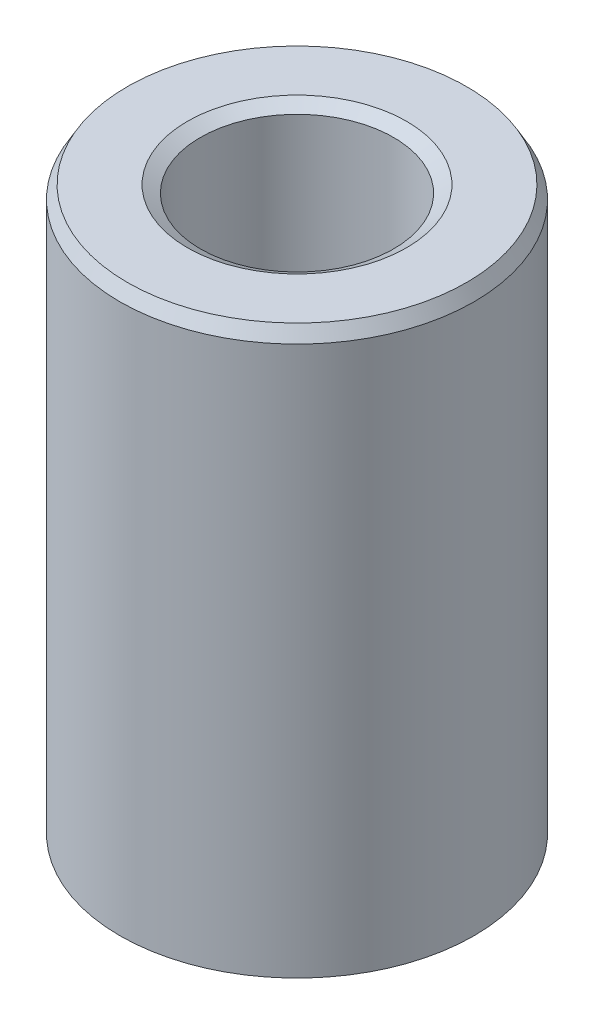
ISO-10303-21;
HEADER;
FILE_DESCRIPTION(('STEP AP214'),'2;1');
FILE_NAME('part.step','',(''),(''),'','','');
FILE_SCHEMA(('AUTOMOTIVE_DESIGN { 1 0 10303 214 1 1 1 1 }'));
ENDSEC;
DATA;
#1=APPLICATION_CONTEXT('core data for automotive mechanical design processes');
#2=APPLICATION_PROTOCOL_DEFINITION('international standard','automotive_design',2000,#1);
#3=PRODUCT_CONTEXT('',#1,'mechanical');
#4=PRODUCT('Part','Part','',(#3));
#5=PRODUCT_RELATED_PRODUCT_CATEGORY('part','',(#4));
#6=PRODUCT_DEFINITION_FORMATION('','',#4);
#7=PRODUCT_DEFINITION_CONTEXT('part definition',#1,'design');
#8=PRODUCT_DEFINITION('design','',#6,#7);
#9=PRODUCT_DEFINITION_SHAPE('','',#8);
#10=(LENGTH_UNIT() NAMED_UNIT(*) SI_UNIT(.MILLI.,.METRE.));
#11=(NAMED_UNIT(*) PLANE_ANGLE_UNIT() SI_UNIT($,.RADIAN.));
#12=(NAMED_UNIT(*) SI_UNIT($,.STERADIAN.) SOLID_ANGLE_UNIT());
#13=UNCERTAINTY_MEASURE_WITH_UNIT(LENGTH_MEASURE(1.E-05),#10,'distance_accuracy_value','');
#14=(GEOMETRIC_REPRESENTATION_CONTEXT(3) GLOBAL_UNCERTAINTY_ASSIGNED_CONTEXT((#13)) GLOBAL_UNIT_ASSIGNED_CONTEXT((#10,
#11,#12)) REPRESENTATION_CONTEXT('',''));
#15=CARTESIAN_POINT('',(0.,0.,0.));
#16=DIRECTION('',(0.,0.,1.));
#17=DIRECTION('',(1.,0.,0.));
#18=AXIS2_PLACEMENT_3D('',#15,#16,#17);
#19=CARTESIAN_POINT('',(0.,16.0737459740507,0.));
#20=DIRECTION('',(0.,-1.,0.));
#21=DIRECTION('',(0.,0.,-1.));
#22=AXIS2_PLACEMENT_3D('',#19,#20,#21);
#23=CYLINDRICAL_SURFACE('',#22,5.);
#24=CARTESIAN_POINT('',(0.,0.211234160088856,0.));
#25=DIRECTION('',(0.,1.,0.));
#26=DIRECTION('',(0.,0.,1.));
#27=AXIS2_PLACEMENT_3D('',#24,#25,#26);
#28=CIRCLE('',#27,5.);
#29=CARTESIAN_POINT('',(0.,0.211234160088856,5.));
#30=VERTEX_POINT('',#29);
#31=EDGE_CURVE('E10',#30,#30,#28,.T.);
#32=ORIENTED_EDGE('',*,*,#31,.T.);
#33=EDGE_LOOP('',(#32));
#34=FACE_BOUND('',#33,.T.);
#35=CARTESIAN_POINT('',(0.,15.7078776764826,0.));
#36=DIRECTION('',(0.,1.,0.));
#37=DIRECTION('',(0.,0.,1.));
#38=AXIS2_PLACEMENT_3D('',#35,#36,#37);
#39=CIRCLE('',#38,5.);
#40=CARTESIAN_POINT('',(0.,15.7078776764826,5.));
#41=VERTEX_POINT('',#40);
#42=EDGE_CURVE('E50',#41,#41,#39,.F.);
#43=ORIENTED_EDGE('',*,*,#42,.T.);
#44=EDGE_LOOP('',(#43));
#45=FACE_BOUND('',#44,.T.);
#46=ADVANCED_FACE('F39',(#34,#45),#23,.T.);
#47=CARTESIAN_POINT('',(0.,16.0737459740507,0.));
#48=DIRECTION('',(0.,1.,0.));
#49=DIRECTION('',(0.,0.,1.));
#50=AXIS2_PLACEMENT_3D('',#47,#48,#49);
#51=PLANE('',#50);
#52=CARTESIAN_POINT('',(0.,16.0737459740507,0.));
#53=DIRECTION('',(0.,1.,0.));
#54=DIRECTION('',(0.,0.,1.));
#55=AXIS2_PLACEMENT_3D('',#52,#53,#54);
#56=CIRCLE('',#55,3.09296491608911);
#57=CARTESIAN_POINT('',(0.,16.0737459740507,3.09296491608911));
#58=VERTEX_POINT('',#57);
#59=EDGE_CURVE('E58',#58,#58,#56,.F.);
#60=ORIENTED_EDGE('',*,*,#59,.T.);
#61=EDGE_LOOP('',(#60));
#62=FACE_BOUND('',#61,.T.);
#63=CARTESIAN_POINT('',(0.,16.0737459740507,0.));
#64=DIRECTION('',(0.,1.,0.));
#65=DIRECTION('',(0.,0.,1.));
#66=AXIS2_PLACEMENT_3D('',#63,#64,#65);
#67=CIRCLE('',#66,4.78876583991115);
#68=CARTESIAN_POINT('',(0.,16.0737459740507,4.78876583991115));
#69=VERTEX_POINT('',#68);
#70=EDGE_CURVE('E61',#69,#69,#67,.T.);
#71=ORIENTED_EDGE('',*,*,#70,.T.);
#72=EDGE_LOOP('',(#71));
#73=FACE_BOUND('',#72,.T.);
#74=ADVANCED_FACE('F88',(#62,#73),#51,.T.);
#75=CARTESIAN_POINT('',(0.,0.,0.));
#76=DIRECTION('',(0.,1.,0.));
#77=DIRECTION('',(0.,0.,1.));
#78=AXIS2_PLACEMENT_3D('',#75,#76,#77);
#79=PLANE('',#78);
#80=CARTESIAN_POINT('',(0.,0.,0.));
#81=DIRECTION('',(0.,1.,0.));
#82=DIRECTION('',(0.,0.,1.));
#83=AXIS2_PLACEMENT_3D('',#80,#81,#82);
#84=CIRCLE('',#83,2.93833077860993);
#85=CARTESIAN_POINT('',(0.,0.,2.93833077860993));
#86=VERTEX_POINT('',#85);
#87=EDGE_CURVE('E51',#86,#86,#84,.T.);
#88=ORIENTED_EDGE('',*,*,#87,.T.);
#89=EDGE_LOOP('',(#88));
#90=FACE_BOUND('',#89,.T.);
#91=CARTESIAN_POINT('',(0.,0.,0.));
#92=DIRECTION('',(0.,1.,0.));
#93=DIRECTION('',(0.,0.,1.));
#94=AXIS2_PLACEMENT_3D('',#91,#92,#93);
#95=CIRCLE('',#94,4.63413170243197);
#96=CARTESIAN_POINT('',(0.,0.,4.63413170243197));
#97=VERTEX_POINT('',#96);
#98=EDGE_CURVE('E54',#97,#97,#95,.F.);
#99=ORIENTED_EDGE('',*,*,#98,.T.);
#100=EDGE_LOOP('',(#99));
#101=FACE_BOUND('',#100,.T.);
#102=ADVANCED_FACE('F83',(#90,#101),#79,.F.);
#103=CARTESIAN_POINT('',(0.,16.0737459740507,0.));
#104=DIRECTION('',(0.,-1.,0.));
#105=DIRECTION('',(0.,0.,-1.));
#106=AXIS2_PLACEMENT_3D('',#103,#104,#105);
#107=CYLINDRICAL_SURFACE('',#106,2.72709661852107);
#108=CARTESIAN_POINT('',(0.,15.8625118139618,0.));
#109=DIRECTION('',(0.,1.,0.));
#110=DIRECTION('',(0.,0.,1.));
#111=AXIS2_PLACEMENT_3D('',#108,#109,#110);
#112=CIRCLE('',#111,2.72709661852107);
#113=CARTESIAN_POINT('',(0.,15.8625118139618,2.72709661852107));
#114=VERTEX_POINT('',#113);
#115=EDGE_CURVE('E67',#114,#114,#112,.T.);
#116=ORIENTED_EDGE('',*,*,#115,.T.);
#117=EDGE_LOOP('',(#116));
#118=FACE_BOUND('',#117,.T.);
#119=CARTESIAN_POINT('',(0.,0.365868297568042,0.));
#120=DIRECTION('',(0.,1.,0.));
#121=DIRECTION('',(0.,0.,1.));
#122=AXIS2_PLACEMENT_3D('',#119,#120,#121);
#123=CIRCLE('',#122,2.72709661852107);
#124=CARTESIAN_POINT('',(0.,0.365868297568042,2.72709661852107));
#125=VERTEX_POINT('',#124);
#126=EDGE_CURVE('E69',#125,#125,#123,.F.);
#127=ORIENTED_EDGE('',*,*,#126,.T.);
#128=EDGE_LOOP('',(#127));
#129=FACE_BOUND('',#128,.T.);
#130=ADVANCED_FACE('F71',(#118,#129),#107,.F.);
#131=CARTESIAN_POINT('',(0.,15.8625118139618,0.));
#132=DIRECTION('',(0.,1.,0.));
#133=DIRECTION('',(0.,0.,1.));
#134=AXIS2_PLACEMENT_3D('',#131,#132,#133);
#135=CONICAL_SURFACE('',#134,2.72709661852107,1.0471975511966);
#136=ORIENTED_EDGE('',*,*,#59,.F.);
#137=EDGE_LOOP('',(#136));
#138=FACE_BOUND('',#137,.T.);
#139=ORIENTED_EDGE('',*,*,#115,.F.);
#140=EDGE_LOOP('',(#139));
#141=FACE_BOUND('',#140,.T.);
#142=ADVANCED_FACE('F77',(#138,#141),#135,.F.);
#143=CARTESIAN_POINT('',(0.,0.,0.));
#144=DIRECTION('',(0.,-1.,0.));
#145=DIRECTION('',(0.,0.,-1.));
#146=AXIS2_PLACEMENT_3D('',#143,#144,#145);
#147=CONICAL_SURFACE('',#146,2.93833077860993,0.523598775598298);
#148=ORIENTED_EDGE('',*,*,#126,.F.);
#149=EDGE_LOOP('',(#148));
#150=FACE_BOUND('',#149,.T.);
#151=ORIENTED_EDGE('',*,*,#87,.F.);
#152=EDGE_LOOP('',(#151));
#153=FACE_BOUND('',#152,.T.);
#154=ADVANCED_FACE('F73',(#150,#153),#147,.F.);
#155=CARTESIAN_POINT('',(0.,0.211234160088856,0.));
#156=DIRECTION('',(0.,1.,0.));
#157=DIRECTION('',(0.,0.,1.));
#158=AXIS2_PLACEMENT_3D('',#155,#156,#157);
#159=CONICAL_SURFACE('',#158,5.,1.04719755119659);
#160=ORIENTED_EDGE('',*,*,#98,.F.);
#161=EDGE_LOOP('',(#160));
#162=FACE_BOUND('',#161,.T.);
#163=ORIENTED_EDGE('',*,*,#31,.F.);
#164=EDGE_LOOP('',(#163));
#165=FACE_BOUND('',#164,.T.);
#166=ADVANCED_FACE('F76',(#162,#165),#159,.T.);
#167=CARTESIAN_POINT('',(0.,16.0737459740507,0.));
#168=DIRECTION('',(0.,-1.,0.));
#169=DIRECTION('',(0.,0.,-1.));
#170=AXIS2_PLACEMENT_3D('',#167,#168,#169);
#171=CONICAL_SURFACE('',#170,4.78876583991115,0.523598775598297);
#172=ORIENTED_EDGE('',*,*,#42,.F.);
#173=EDGE_LOOP('',(#172));
#174=FACE_BOUND('',#173,.T.);
#175=ORIENTED_EDGE('',*,*,#70,.F.);
#176=EDGE_LOOP('',(#175));
#177=FACE_BOUND('',#176,.T.);
#178=ADVANCED_FACE('F45',(#174,#177),#171,.T.);
#179=CLOSED_SHELL('',(#46,#74,#102,#130,#142,#154,#166,#178));
#180=MANIFOLD_SOLID_BREP('B2',#179);
#181=ADVANCED_BREP_SHAPE_REPRESENTATION('',(#18,#180),#14);
#182=SHAPE_DEFINITION_REPRESENTATION(#9,#181);
ENDSEC;
END-ISO-10303-21;
